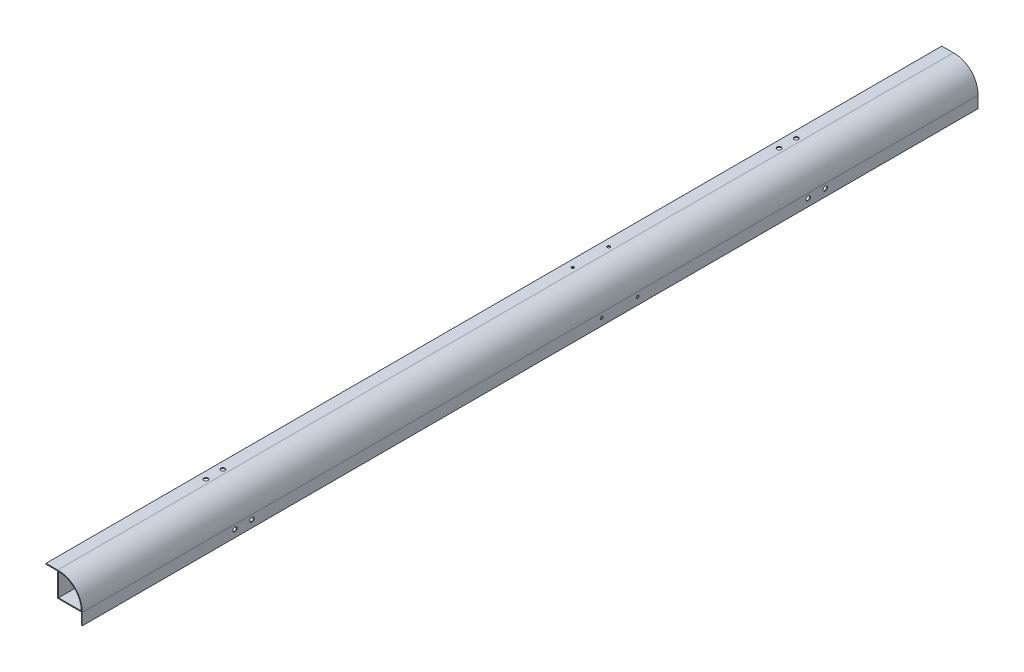
ISO-10303-21;
HEADER;
FILE_DESCRIPTION(('STEP AP214'),'2;1');
FILE_NAME('part.step','',(''),(''),'','','');
FILE_SCHEMA(('AUTOMOTIVE_DESIGN { 1 0 10303 214 1 1 1 1 }'));
ENDSEC;
DATA;
#1=APPLICATION_CONTEXT('core data for automotive mechanical design processes');
#2=APPLICATION_PROTOCOL_DEFINITION('international standard','automotive_design',2000,#1);
#3=PRODUCT_CONTEXT('',#1,'mechanical');
#4=PRODUCT('Part','Part','',(#3));
#5=PRODUCT_RELATED_PRODUCT_CATEGORY('part','',(#4));
#6=PRODUCT_DEFINITION_FORMATION('','',#4);
#7=PRODUCT_DEFINITION_CONTEXT('part definition',#1,'design');
#8=PRODUCT_DEFINITION('design','',#6,#7);
#9=PRODUCT_DEFINITION_SHAPE('','',#8);
#10=(LENGTH_UNIT() NAMED_UNIT(*) SI_UNIT(.MILLI.,.METRE.));
#11=(NAMED_UNIT(*) PLANE_ANGLE_UNIT() SI_UNIT($,.RADIAN.));
#12=(NAMED_UNIT(*) SI_UNIT($,.STERADIAN.) SOLID_ANGLE_UNIT());
#13=UNCERTAINTY_MEASURE_WITH_UNIT(LENGTH_MEASURE(1.E-05),#10,'distance_accuracy_value','');
#14=(GEOMETRIC_REPRESENTATION_CONTEXT(3) GLOBAL_UNCERTAINTY_ASSIGNED_CONTEXT((#13)) GLOBAL_UNIT_ASSIGNED_CONTEXT((#10,
#11,#12)) REPRESENTATION_CONTEXT('',''));
#15=CARTESIAN_POINT('',(0.,0.,0.));
#16=DIRECTION('',(0.,0.,1.));
#17=DIRECTION('',(1.,0.,0.));
#18=AXIS2_PLACEMENT_3D('',#15,#16,#17);
#19=CARTESIAN_POINT('',(12.6810538076097,0.,500.));
#20=DIRECTION('',(1.,0.,0.));
#21=DIRECTION('',(0.,1.,0.));
#22=AXIS2_PLACEMENT_3D('',#19,#20,#21);
#23=PLANE('',#22);
#24=CARTESIAN_POINT('',(12.6810538076097,-18.7,-120.));
#25=DIRECTION('',(1.,0.,0.));
#26=DIRECTION('',(0.,1.,0.));
#27=AXIS2_PLACEMENT_3D('',#24,#25,#26);
#28=CIRCLE('',#27,1.5);
#29=CARTESIAN_POINT('',(12.6810538076097,-17.2,-120.));
#30=VERTEX_POINT('',#29);
#31=EDGE_CURVE('E233',#30,#30,#28,.T.);
#32=ORIENTED_EDGE('',*,*,#31,.T.);
#33=EDGE_LOOP('',(#32));
#34=FACE_BOUND('',#33,.T.);
#35=DIRECTION('',(0.,-1.,0.));
#36=VECTOR('',#35,1.);
#37=CARTESIAN_POINT('',(12.6810538076097,0.,-500.));
#38=LINE('',#37,#36);
#39=CARTESIAN_POINT('',(12.6810538076097,-13.7,-500.));
#40=VERTEX_POINT('',#39);
#41=CARTESIAN_POINT('',(12.6810538076097,-26.7,-500.));
#42=VERTEX_POINT('',#41);
#43=EDGE_CURVE('E276',#40,#42,#38,.T.);
#44=ORIENTED_EDGE('',*,*,#43,.T.);
#45=DIRECTION('',(0.,0.,-1.));
#46=VECTOR('',#45,1.);
#47=CARTESIAN_POINT('',(12.6810538076097,-26.7,500.));
#48=LINE('',#47,#46);
#49=CARTESIAN_POINT('',(12.6810538076097,-26.7,500.));
#50=VERTEX_POINT('',#49);
#51=EDGE_CURVE('E166',#50,#42,#48,.T.);
#52=ORIENTED_EDGE('',*,*,#51,.F.);
#53=DIRECTION('',(0.,-1.,0.));
#54=VECTOR('',#53,1.);
#55=CARTESIAN_POINT('',(12.6810538076097,0.,500.));
#56=LINE('',#55,#54);
#57=CARTESIAN_POINT('',(12.6810538076097,-13.7,500.));
#58=VERTEX_POINT('',#57);
#59=EDGE_CURVE('E253',#58,#50,#56,.T.);
#60=ORIENTED_EDGE('',*,*,#59,.F.);
#61=DIRECTION('',(0.,0.,-1.));
#62=VECTOR('',#61,1.);
#63=CARTESIAN_POINT('',(12.6810538076097,-13.7,500.));
#64=LINE('',#63,#62);
#65=EDGE_CURVE('E168',#58,#40,#64,.T.);
#66=ORIENTED_EDGE('',*,*,#65,.T.);
#67=EDGE_LOOP('',(#44,#52,#60,#66));
#68=FACE_BOUND('',#67,.T.);
#69=CARTESIAN_POINT('',(12.6810538076097,-18.7,-80.));
#70=DIRECTION('',(1.,0.,0.));
#71=DIRECTION('',(0.,1.,0.));
#72=AXIS2_PLACEMENT_3D('',#69,#70,#71);
#73=CIRCLE('',#72,1.5);
#74=CARTESIAN_POINT('',(12.6810538076097,-17.2,-80.));
#75=VERTEX_POINT('',#74);
#76=EDGE_CURVE('E221',#75,#75,#73,.F.);
#77=ORIENTED_EDGE('',*,*,#76,.F.);
#78=EDGE_LOOP('',(#77));
#79=FACE_BOUND('',#78,.T.);
#80=CARTESIAN_POINT('',(12.6810538076097,-18.7000000000001,329.5));
#81=DIRECTION('',(1.,0.,0.));
#82=DIRECTION('',(0.,1.,0.));
#83=AXIS2_PLACEMENT_3D('',#80,#81,#82);
#84=CIRCLE('',#83,2.38125000000001);
#85=CARTESIAN_POINT('',(12.6810538076097,-16.3187500000001,329.5));
#86=VERTEX_POINT('',#85);
#87=EDGE_CURVE('E224',#86,#86,#84,.F.);
#88=ORIENTED_EDGE('',*,*,#87,.F.);
#89=EDGE_LOOP('',(#88));
#90=FACE_BOUND('',#89,.T.);
#91=CARTESIAN_POINT('',(12.6810538076097,-18.7000000000001,310.5));
#92=DIRECTION('',(1.,0.,0.));
#93=DIRECTION('',(0.,1.,0.));
#94=AXIS2_PLACEMENT_3D('',#91,#92,#93);
#95=CIRCLE('',#94,2.38125000000001);
#96=CARTESIAN_POINT('',(12.6810538076097,-16.3187500000001,310.5));
#97=VERTEX_POINT('',#96);
#98=EDGE_CURVE('E227',#97,#97,#95,.F.);
#99=ORIENTED_EDGE('',*,*,#98,.F.);
#100=EDGE_LOOP('',(#99));
#101=FACE_BOUND('',#100,.T.);
#102=CARTESIAN_POINT('',(12.6810538076097,-18.7,-310.5));
#103=DIRECTION('',(1.,0.,0.));
#104=DIRECTION('',(0.,1.,0.));
#105=AXIS2_PLACEMENT_3D('',#102,#103,#104);
#106=CIRCLE('',#105,2.38125000000001);
#107=CARTESIAN_POINT('',(12.6810538076097,-16.31875,-310.5));
#108=VERTEX_POINT('',#107);
#109=EDGE_CURVE('E230',#108,#108,#106,.T.);
#110=ORIENTED_EDGE('',*,*,#109,.T.);
#111=EDGE_LOOP('',(#110));
#112=FACE_BOUND('',#111,.T.);
#113=CARTESIAN_POINT('',(12.6810538076097,-18.7,-329.5));
#114=DIRECTION('',(1.,0.,0.));
#115=DIRECTION('',(0.,1.,0.));
#116=AXIS2_PLACEMENT_3D('',#113,#114,#115);
#117=CIRCLE('',#116,2.38125000000001);
#118=CARTESIAN_POINT('',(12.6810538076097,-16.31875,-329.5));
#119=VERTEX_POINT('',#118);
#120=EDGE_CURVE('E236',#119,#119,#117,.T.);
#121=ORIENTED_EDGE('',*,*,#120,.T.);
#122=EDGE_LOOP('',(#121));
#123=FACE_BOUND('',#122,.T.);
#124=ADVANCED_FACE('F36',(#34,#68,#79,#90,#101,#112,#123),#23,.F.);
#125=CARTESIAN_POINT('',(13.6810538076097,0.,500.));
#126=DIRECTION('',(1.,0.,0.));
#127=DIRECTION('',(0.,0.,-1.));
#128=AXIS2_PLACEMENT_3D('',#125,#126,#127);
#129=PLANE('',#128);
#130=CARTESIAN_POINT('',(13.6810538076097,-18.7000000000001,310.5));
#131=DIRECTION('',(-1.,0.,0.));
#132=DIRECTION('',(0.,-1.,0.));
#133=AXIS2_PLACEMENT_3D('',#130,#131,#132);
#134=CIRCLE('',#133,2.38125000000001);
#135=CARTESIAN_POINT('',(13.6810538076097,-21.0812500000001,310.5));
#136=VERTEX_POINT('',#135);
#137=EDGE_CURVE('E214',#136,#136,#134,.T.);
#138=ORIENTED_EDGE('',*,*,#137,.T.);
#139=EDGE_LOOP('',(#138));
#140=FACE_BOUND('',#139,.T.);
#141=CARTESIAN_POINT('',(13.6810538076097,-18.7000000000001,329.5));
#142=DIRECTION('',(-1.,0.,0.));
#143=DIRECTION('',(0.,-1.,0.));
#144=AXIS2_PLACEMENT_3D('',#141,#142,#143);
#145=CIRCLE('',#144,2.38125000000001);
#146=CARTESIAN_POINT('',(13.6810538076097,-21.0812500000001,329.5));
#147=VERTEX_POINT('',#146);
#148=EDGE_CURVE('E207',#147,#147,#145,.T.);
#149=ORIENTED_EDGE('',*,*,#148,.T.);
#150=EDGE_LOOP('',(#149));
#151=FACE_BOUND('',#150,.T.);
#152=CARTESIAN_POINT('',(13.6810538076097,-18.7,-80.));
#153=DIRECTION('',(-1.,0.,0.));
#154=DIRECTION('',(0.,-1.,0.));
#155=AXIS2_PLACEMENT_3D('',#152,#153,#154);
#156=CIRCLE('',#155,1.5);
#157=CARTESIAN_POINT('',(13.6810538076097,-20.2,-80.));
#158=VERTEX_POINT('',#157);
#159=EDGE_CURVE('E202',#158,#158,#156,.T.);
#160=ORIENTED_EDGE('',*,*,#159,.T.);
#161=EDGE_LOOP('',(#160));
#162=FACE_BOUND('',#161,.T.);
#163=DIRECTION('',(0.,-1.,0.));
#164=VECTOR('',#163,1.);
#165=CARTESIAN_POINT('',(13.6810538076097,0.,-500.));
#166=LINE('',#165,#164);
#167=CARTESIAN_POINT('',(13.6810538076097,-13.7,-500.));
#168=VERTEX_POINT('',#167);
#169=CARTESIAN_POINT('',(13.6810538076097,-26.7,-500.));
#170=VERTEX_POINT('',#169);
#171=EDGE_CURVE('E149',#168,#170,#166,.T.);
#172=ORIENTED_EDGE('',*,*,#171,.F.);
#173=DIRECTION('',(0.,0.,-1.));
#174=VECTOR('',#173,1.);
#175=CARTESIAN_POINT('',(13.6810538076097,-13.7,500.));
#176=LINE('',#175,#174);
#177=CARTESIAN_POINT('',(13.6810538076097,-13.7,500.));
#178=VERTEX_POINT('',#177);
#179=EDGE_CURVE('E162',#178,#168,#176,.T.);
#180=ORIENTED_EDGE('',*,*,#179,.F.);
#181=DIRECTION('',(0.,-1.,0.));
#182=VECTOR('',#181,1.);
#183=CARTESIAN_POINT('',(13.6810538076097,0.,500.));
#184=LINE('',#183,#182);
#185=CARTESIAN_POINT('',(13.6810538076097,-26.7,500.));
#186=VERTEX_POINT('',#185);
#187=EDGE_CURVE('E142',#178,#186,#184,.T.);
#188=ORIENTED_EDGE('',*,*,#187,.T.);
#189=DIRECTION('',(0.,0.,-1.));
#190=VECTOR('',#189,1.);
#191=CARTESIAN_POINT('',(13.6810538076097,-26.7,500.));
#192=LINE('',#191,#190);
#193=EDGE_CURVE('E164',#186,#170,#192,.T.);
#194=ORIENTED_EDGE('',*,*,#193,.T.);
#195=EDGE_LOOP('',(#172,#180,#188,#194));
#196=FACE_BOUND('',#195,.T.);
#197=CARTESIAN_POINT('',(13.6810538076097,-18.7,-310.5));
#198=DIRECTION('',(1.,0.,0.));
#199=DIRECTION('',(0.,1.,0.));
#200=AXIS2_PLACEMENT_3D('',#197,#198,#199);
#201=CIRCLE('',#200,2.38125000000001);
#202=CARTESIAN_POINT('',(13.6810538076097,-16.31875,-310.5));
#203=VERTEX_POINT('',#202);
#204=EDGE_CURVE('E216',#203,#203,#201,.T.);
#205=ORIENTED_EDGE('',*,*,#204,.F.);
#206=EDGE_LOOP('',(#205));
#207=FACE_BOUND('',#206,.T.);
#208=CARTESIAN_POINT('',(13.6810538076097,-18.7,-120.));
#209=DIRECTION('',(1.,0.,0.));
#210=DIRECTION('',(0.,1.,0.));
#211=AXIS2_PLACEMENT_3D('',#208,#209,#210);
#212=CIRCLE('',#211,1.5);
#213=CARTESIAN_POINT('',(13.6810538076097,-17.2,-120.));
#214=VERTEX_POINT('',#213);
#215=EDGE_CURVE('E198',#214,#214,#212,.T.);
#216=ORIENTED_EDGE('',*,*,#215,.F.);
#217=EDGE_LOOP('',(#216));
#218=FACE_BOUND('',#217,.T.);
#219=CARTESIAN_POINT('',(13.6810538076097,-18.7,-329.5));
#220=DIRECTION('',(1.,0.,0.));
#221=DIRECTION('',(0.,1.,0.));
#222=AXIS2_PLACEMENT_3D('',#219,#220,#221);
#223=CIRCLE('',#222,2.38125000000001);
#224=CARTESIAN_POINT('',(13.6810538076097,-16.31875,-329.5));
#225=VERTEX_POINT('',#224);
#226=EDGE_CURVE('E211',#225,#225,#223,.T.);
#227=ORIENTED_EDGE('',*,*,#226,.F.);
#228=EDGE_LOOP('',(#227));
#229=FACE_BOUND('',#228,.T.);
#230=ADVANCED_FACE('F317',(#140,#151,#162,#196,#207,#218,#229),#129,.T.);
#231=CARTESIAN_POINT('',(-12.7,0.,500.));
#232=DIRECTION('',(-1.,0.,0.));
#233=DIRECTION('',(0.,-1.,0.));
#234=AXIS2_PLACEMENT_3D('',#231,#232,#233);
#235=PLANE('',#234);
#236=DIRECTION('',(0.,1.,0.));
#237=VECTOR('',#236,1.);
#238=CARTESIAN_POINT('',(-12.7,0.,-500.));
#239=LINE('',#238,#237);
#240=CARTESIAN_POINT('',(-12.7,-12.7,-500.));
#241=VERTEX_POINT('',#240);
#242=CARTESIAN_POINT('',(-12.7,12.7,-500.));
#243=VERTEX_POINT('',#242);
#244=EDGE_CURVE('E145',#241,#243,#239,.T.);
#245=ORIENTED_EDGE('',*,*,#244,.T.);
#246=DIRECTION('',(0.,0.,-1.));
#247=VECTOR('',#246,1.);
#248=CARTESIAN_POINT('',(-12.7,12.7,500.));
#249=LINE('',#248,#247);
#250=CARTESIAN_POINT('',(-12.7,12.7,500.));
#251=VERTEX_POINT('',#250);
#252=EDGE_CURVE('E11',#251,#243,#249,.T.);
#253=ORIENTED_EDGE('',*,*,#252,.F.);
#254=DIRECTION('',(0.,1.,0.));
#255=VECTOR('',#254,1.);
#256=CARTESIAN_POINT('',(-12.7,0.,500.));
#257=LINE('',#256,#255);
#258=CARTESIAN_POINT('',(-12.7,-12.7,500.));
#259=VERTEX_POINT('',#258);
#260=EDGE_CURVE('E139',#259,#251,#257,.T.);
#261=ORIENTED_EDGE('',*,*,#260,.F.);
#262=DIRECTION('',(0.,0.,-1.));
#263=VECTOR('',#262,1.);
#264=CARTESIAN_POINT('',(-12.7,-12.7,500.));
#265=LINE('',#264,#263);
#266=EDGE_CURVE('E55',#259,#241,#265,.T.);
#267=ORIENTED_EDGE('',*,*,#266,.T.);
#268=EDGE_LOOP('',(#245,#253,#261,#267));
#269=FACE_BOUND('',#268,.T.);
#270=ADVANCED_FACE('F144',(#269),#235,.F.);
#271=CARTESIAN_POINT('',(-12.7,-12.7,500.));
#272=DIRECTION('',(0.,0.,-1.));
#273=DIRECTION('',(-1.,0.,0.));
#274=AXIS2_PLACEMENT_3D('',#271,#272,#273);
#275=CYLINDRICAL_SURFACE('',#274,25.4);
#276=CARTESIAN_POINT('',(-12.7,-12.7,-500.));
#277=DIRECTION('',(0.,0.,1.));
#278=DIRECTION('',(1.,0.,0.));
#279=AXIS2_PLACEMENT_3D('',#276,#277,#278);
#280=CIRCLE('',#279,25.4);
#281=CARTESIAN_POINT('',(12.7,-12.7,-500.));
#282=VERTEX_POINT('',#281);
#283=EDGE_CURVE('E148',#243,#282,#280,.F.);
#284=ORIENTED_EDGE('',*,*,#283,.T.);
#285=DIRECTION('',(0.,0.,-1.));
#286=VECTOR('',#285,1.);
#287=CARTESIAN_POINT('',(12.7,-12.7,500.));
#288=LINE('',#287,#286);
#289=CARTESIAN_POINT('',(12.7,-12.7,500.));
#290=VERTEX_POINT('',#289);
#291=EDGE_CURVE('E46',#290,#282,#288,.T.);
#292=ORIENTED_EDGE('',*,*,#291,.F.);
#293=CARTESIAN_POINT('',(-12.7,-12.7,500.));
#294=DIRECTION('',(0.,0.,1.));
#295=DIRECTION('',(1.,0.,0.));
#296=AXIS2_PLACEMENT_3D('',#293,#294,#295);
#297=CIRCLE('',#296,25.4);
#298=EDGE_CURVE('E132',#251,#290,#297,.F.);
#299=ORIENTED_EDGE('',*,*,#298,.F.);
#300=ORIENTED_EDGE('',*,*,#252,.T.);
#301=EDGE_LOOP('',(#284,#292,#299,#300));
#302=FACE_BOUND('',#301,.T.);
#303=ADVANCED_FACE('F134',(#302),#275,.F.);
#304=CARTESIAN_POINT('',(-12.7,-12.7,500.));
#305=DIRECTION('',(0.,0.,-1.));
#306=DIRECTION('',(-1.,0.,0.));
#307=AXIS2_PLACEMENT_3D('',#304,#305,#306);
#308=CYLINDRICAL_SURFACE('',#307,26.4);
#309=CARTESIAN_POINT('',(-12.7,-12.7,-500.));
#310=DIRECTION('',(0.,0.,1.));
#311=DIRECTION('',(1.,0.,0.));
#312=AXIS2_PLACEMENT_3D('',#309,#310,#311);
#313=CIRCLE('',#312,26.4);
#314=CARTESIAN_POINT('',(-13.7,13.6810538076097,-500.));
#315=VERTEX_POINT('',#314);
#316=EDGE_CURVE('E239',#315,#168,#313,.F.);
#317=ORIENTED_EDGE('',*,*,#316,.F.);
#318=DIRECTION('',(0.,0.,-1.));
#319=VECTOR('',#318,1.);
#320=CARTESIAN_POINT('',(-13.7,13.6810538076097,500.));
#321=LINE('',#320,#319);
#322=CARTESIAN_POINT('',(-13.7,13.6810538076097,500.));
#323=VERTEX_POINT('',#322);
#324=EDGE_CURVE('E105',#323,#315,#321,.T.);
#325=ORIENTED_EDGE('',*,*,#324,.F.);
#326=CARTESIAN_POINT('',(-12.7,-12.7,500.));
#327=DIRECTION('',(0.,0.,1.));
#328=DIRECTION('',(1.,0.,0.));
#329=AXIS2_PLACEMENT_3D('',#326,#327,#328);
#330=CIRCLE('',#329,26.4);
#331=EDGE_CURVE('E159',#323,#178,#330,.F.);
#332=ORIENTED_EDGE('',*,*,#331,.T.);
#333=ORIENTED_EDGE('',*,*,#179,.T.);
#334=EDGE_LOOP('',(#317,#325,#332,#333));
#335=FACE_BOUND('',#334,.T.);
#336=ADVANCED_FACE('F38',(#335),#308,.T.);
#337=CARTESIAN_POINT('',(0.,13.6810538076097,500.));
#338=DIRECTION('',(0.,-1.,0.));
#339=DIRECTION('',(0.,0.,-1.));
#340=AXIS2_PLACEMENT_3D('',#337,#338,#339);
#341=PLANE('',#340);
#342=CARTESIAN_POINT('',(-18.7,13.6810538076097,-329.5));
#343=DIRECTION('',(0.,1.,0.));
#344=DIRECTION('',(-1.,0.,0.));
#345=AXIS2_PLACEMENT_3D('',#342,#343,#344);
#346=CIRCLE('',#345,2.38125000000004);
#347=CARTESIAN_POINT('',(-21.08125,13.6810538076097,-329.5));
#348=VERTEX_POINT('',#347);
#349=EDGE_CURVE('E185',#348,#348,#346,.T.);
#350=ORIENTED_EDGE('',*,*,#349,.F.);
#351=EDGE_LOOP('',(#350));
#352=FACE_BOUND('',#351,.T.);
#353=CARTESIAN_POINT('',(-18.7,13.6810538076097,-79.9999999999999));
#354=DIRECTION('',(0.,1.,0.));
#355=DIRECTION('',(1.,0.,0.));
#356=AXIS2_PLACEMENT_3D('',#353,#354,#355);
#357=CIRCLE('',#356,1.5);
#358=CARTESIAN_POINT('',(-17.2,13.6810538076097,-79.9999999999999));
#359=VERTEX_POINT('',#358);
#360=EDGE_CURVE('E362',#359,#359,#357,.T.);
#361=ORIENTED_EDGE('',*,*,#360,.F.);
#362=EDGE_LOOP('',(#361));
#363=FACE_BOUND('',#362,.T.);
#364=CARTESIAN_POINT('',(-18.7,13.6810538076097,-310.5));
#365=DIRECTION('',(0.,1.,0.));
#366=DIRECTION('',(-1.,0.,0.));
#367=AXIS2_PLACEMENT_3D('',#364,#365,#366);
#368=CIRCLE('',#367,2.38125000000004);
#369=CARTESIAN_POINT('',(-21.08125,13.6810538076097,-310.5));
#370=VERTEX_POINT('',#369);
#371=EDGE_CURVE('E366',#370,#370,#368,.T.);
#372=ORIENTED_EDGE('',*,*,#371,.F.);
#373=EDGE_LOOP('',(#372));
#374=FACE_BOUND('',#373,.T.);
#375=CARTESIAN_POINT('',(-18.6999999999999,13.6810538076097,310.5));
#376=DIRECTION('',(0.,1.,0.));
#377=DIRECTION('',(1.,0.,0.));
#378=AXIS2_PLACEMENT_3D('',#375,#376,#377);
#379=CIRCLE('',#378,2.38125000000004);
#380=CARTESIAN_POINT('',(-16.3187499999999,13.6810538076097,310.5));
#381=VERTEX_POINT('',#380);
#382=EDGE_CURVE('E370',#381,#381,#379,.T.);
#383=ORIENTED_EDGE('',*,*,#382,.F.);
#384=EDGE_LOOP('',(#383));
#385=FACE_BOUND('',#384,.T.);
#386=CARTESIAN_POINT('',(-18.6999999999999,13.6810538076097,329.5));
#387=DIRECTION('',(0.,1.,0.));
#388=DIRECTION('',(1.,0.,0.));
#389=AXIS2_PLACEMENT_3D('',#386,#387,#388);
#390=CIRCLE('',#389,2.38125000000004);
#391=CARTESIAN_POINT('',(-16.3187499999999,13.6810538076097,329.5));
#392=VERTEX_POINT('',#391);
#393=EDGE_CURVE('E374',#392,#392,#390,.T.);
#394=ORIENTED_EDGE('',*,*,#393,.F.);
#395=EDGE_LOOP('',(#394));
#396=FACE_BOUND('',#395,.T.);
#397=CARTESIAN_POINT('',(-18.7,13.6810538076097,-120.));
#398=DIRECTION('',(0.,1.,0.));
#399=DIRECTION('',(-1.,0.,0.));
#400=AXIS2_PLACEMENT_3D('',#397,#398,#399);
#401=CIRCLE('',#400,1.5);
#402=CARTESIAN_POINT('',(-20.2,13.6810538076097,-120.));
#403=VERTEX_POINT('',#402);
#404=EDGE_CURVE('E377',#403,#403,#401,.T.);
#405=ORIENTED_EDGE('',*,*,#404,.F.);
#406=EDGE_LOOP('',(#405));
#407=FACE_BOUND('',#406,.T.);
#408=DIRECTION('',(-1.,0.,0.));
#409=VECTOR('',#408,1.);
#410=CARTESIAN_POINT('',(0.,13.6810538076097,-500.));
#411=LINE('',#410,#409);
#412=CARTESIAN_POINT('',(-26.7,13.6810538076097,-500.));
#413=VERTEX_POINT('',#412);
#414=EDGE_CURVE('E263',#315,#413,#411,.T.);
#415=ORIENTED_EDGE('',*,*,#414,.T.);
#416=DIRECTION('',(0.,0.,-1.));
#417=VECTOR('',#416,1.);
#418=CARTESIAN_POINT('',(-26.7,13.6810538076097,500.));
#419=LINE('',#418,#417);
#420=CARTESIAN_POINT('',(-26.7,13.6810538076097,500.));
#421=VERTEX_POINT('',#420);
#422=EDGE_CURVE('E177',#421,#413,#419,.T.);
#423=ORIENTED_EDGE('',*,*,#422,.F.);
#424=DIRECTION('',(-1.,0.,0.));
#425=VECTOR('',#424,1.);
#426=CARTESIAN_POINT('',(0.,13.6810538076097,500.));
#427=LINE('',#426,#425);
#428=EDGE_CURVE('E241',#323,#421,#427,.T.);
#429=ORIENTED_EDGE('',*,*,#428,.F.);
#430=ORIENTED_EDGE('',*,*,#324,.T.);
#431=EDGE_LOOP('',(#415,#423,#429,#430));
#432=FACE_BOUND('',#431,.T.);
#433=ADVANCED_FACE('F312',(#352,#363,#374,#385,#396,#407,#432),#341,.F.);
#434=CARTESIAN_POINT('',(-26.7,0.,500.));
#435=DIRECTION('',(1.,0.,0.));
#436=DIRECTION('',(0.,0.,-1.));
#437=AXIS2_PLACEMENT_3D('',#434,#435,#436);
#438=PLANE('',#437);
#439=DIRECTION('',(0.,-1.,0.));
#440=VECTOR('',#439,1.);
#441=CARTESIAN_POINT('',(-26.7,0.,-500.));
#442=LINE('',#441,#440);
#443=CARTESIAN_POINT('',(-26.7,12.6810538076097,-500.));
#444=VERTEX_POINT('',#443);
#445=EDGE_CURVE('E265',#413,#444,#442,.T.);
#446=ORIENTED_EDGE('',*,*,#445,.T.);
#447=DIRECTION('',(0.,0.,-1.));
#448=VECTOR('',#447,1.);
#449=CARTESIAN_POINT('',(-26.7,12.6810538076097,500.));
#450=LINE('',#449,#448);
#451=CARTESIAN_POINT('',(-26.7,12.6810538076097,500.));
#452=VERTEX_POINT('',#451);
#453=EDGE_CURVE('E175',#452,#444,#450,.T.);
#454=ORIENTED_EDGE('',*,*,#453,.F.);
#455=DIRECTION('',(0.,-1.,0.));
#456=VECTOR('',#455,1.);
#457=CARTESIAN_POINT('',(-26.7,0.,500.));
#458=LINE('',#457,#456);
#459=EDGE_CURVE('E243',#421,#452,#458,.T.);
#460=ORIENTED_EDGE('',*,*,#459,.F.);
#461=ORIENTED_EDGE('',*,*,#422,.T.);
#462=EDGE_LOOP('',(#446,#454,#460,#461));
#463=FACE_BOUND('',#462,.T.);
#464=ADVANCED_FACE('F308',(#463),#438,.F.);
#465=CARTESIAN_POINT('',(0.,12.6810538076097,500.));
#466=DIRECTION('',(0.,-1.,0.));
#467=DIRECTION('',(1.,0.,0.));
#468=AXIS2_PLACEMENT_3D('',#465,#466,#467);
#469=PLANE('',#468);
#470=CARTESIAN_POINT('',(-18.7,12.6810538076097,-329.5));
#471=DIRECTION('',(0.,-1.,0.));
#472=DIRECTION('',(1.,0.,0.));
#473=AXIS2_PLACEMENT_3D('',#470,#471,#472);
#474=CIRCLE('',#473,2.38125000000004);
#475=CARTESIAN_POINT('',(-16.31875,12.6810538076097,-329.5));
#476=VERTEX_POINT('',#475);
#477=EDGE_CURVE('E40',#476,#476,#474,.T.);
#478=ORIENTED_EDGE('',*,*,#477,.F.);
#479=EDGE_LOOP('',(#478));
#480=FACE_BOUND('',#479,.T.);
#481=CARTESIAN_POINT('',(-18.7,12.6810538076097,-79.9999999999999));
#482=DIRECTION('',(0.,-1.,0.));
#483=DIRECTION('',(1.,0.,0.));
#484=AXIS2_PLACEMENT_3D('',#481,#482,#483);
#485=CIRCLE('',#484,1.5);
#486=CARTESIAN_POINT('',(-17.2,12.6810538076097,-79.9999999999999));
#487=VERTEX_POINT('',#486);
#488=EDGE_CURVE('E193',#487,#487,#485,.T.);
#489=ORIENTED_EDGE('',*,*,#488,.F.);
#490=EDGE_LOOP('',(#489));
#491=FACE_BOUND('',#490,.T.);
#492=CARTESIAN_POINT('',(-18.7,12.6810538076097,-310.5));
#493=DIRECTION('',(0.,-1.,0.));
#494=DIRECTION('',(1.,0.,0.));
#495=AXIS2_PLACEMENT_3D('',#492,#493,#494);
#496=CIRCLE('',#495,2.38125000000004);
#497=CARTESIAN_POINT('',(-16.31875,12.6810538076097,-310.5));
#498=VERTEX_POINT('',#497);
#499=EDGE_CURVE('E191',#498,#498,#496,.T.);
#500=ORIENTED_EDGE('',*,*,#499,.F.);
#501=EDGE_LOOP('',(#500));
#502=FACE_BOUND('',#501,.T.);
#503=CARTESIAN_POINT('',(-18.6999999999999,12.6810538076097,310.5));
#504=DIRECTION('',(0.,-1.,0.));
#505=DIRECTION('',(1.,0.,0.));
#506=AXIS2_PLACEMENT_3D('',#503,#504,#505);
#507=CIRCLE('',#506,2.38125000000004);
#508=CARTESIAN_POINT('',(-16.3187499999999,12.6810538076097,310.5));
#509=VERTEX_POINT('',#508);
#510=EDGE_CURVE('E188',#509,#509,#507,.T.);
#511=ORIENTED_EDGE('',*,*,#510,.F.);
#512=EDGE_LOOP('',(#511));
#513=FACE_BOUND('',#512,.T.);
#514=CARTESIAN_POINT('',(-18.6999999999999,12.6810538076097,329.5));
#515=DIRECTION('',(0.,-1.,0.));
#516=DIRECTION('',(1.,0.,0.));
#517=AXIS2_PLACEMENT_3D('',#514,#515,#516);
#518=CIRCLE('',#517,2.38125000000004);
#519=CARTESIAN_POINT('',(-16.3187499999999,12.6810538076097,329.5));
#520=VERTEX_POINT('',#519);
#521=EDGE_CURVE('E184',#520,#520,#518,.T.);
#522=ORIENTED_EDGE('',*,*,#521,.F.);
#523=EDGE_LOOP('',(#522));
#524=FACE_BOUND('',#523,.T.);
#525=CARTESIAN_POINT('',(-18.7,12.6810538076097,-120.));
#526=DIRECTION('',(0.,-1.,0.));
#527=DIRECTION('',(1.,0.,0.));
#528=AXIS2_PLACEMENT_3D('',#525,#526,#527);
#529=CIRCLE('',#528,1.5);
#530=CARTESIAN_POINT('',(-17.2,12.6810538076097,-120.));
#531=VERTEX_POINT('',#530);
#532=EDGE_CURVE('E181',#531,#531,#529,.T.);
#533=ORIENTED_EDGE('',*,*,#532,.F.);
#534=EDGE_LOOP('',(#533));
#535=FACE_BOUND('',#534,.T.);
#536=DIRECTION('',(-1.,0.,0.));
#537=VECTOR('',#536,1.);
#538=CARTESIAN_POINT('',(0.,12.6810538076097,-500.));
#539=LINE('',#538,#537);
#540=CARTESIAN_POINT('',(-13.7,12.6810538076097,-500.));
#541=VERTEX_POINT('',#540);
#542=EDGE_CURVE('E268',#541,#444,#539,.T.);
#543=ORIENTED_EDGE('',*,*,#542,.F.);
#544=DIRECTION('',(0.,0.,-1.));
#545=VECTOR('',#544,1.);
#546=CARTESIAN_POINT('',(-13.7,12.6810538076097,500.));
#547=LINE('',#546,#545);
#548=CARTESIAN_POINT('',(-13.7,12.6810538076097,500.));
#549=VERTEX_POINT('',#548);
#550=EDGE_CURVE('E173',#549,#541,#547,.T.);
#551=ORIENTED_EDGE('',*,*,#550,.F.);
#552=DIRECTION('',(-1.,0.,0.));
#553=VECTOR('',#552,1.);
#554=CARTESIAN_POINT('',(0.,12.6810538076097,500.));
#555=LINE('',#554,#553);
#556=EDGE_CURVE('E245',#549,#452,#555,.T.);
#557=ORIENTED_EDGE('',*,*,#556,.T.);
#558=ORIENTED_EDGE('',*,*,#453,.T.);
#559=EDGE_LOOP('',(#543,#551,#557,#558));
#560=FACE_BOUND('',#559,.T.);
#561=ADVANCED_FACE('F303',(#480,#491,#502,#513,#524,#535,#560),#469,.T.);
#562=CARTESIAN_POINT('',(-13.7,0.,500.));
#563=DIRECTION('',(-1.,0.,0.));
#564=DIRECTION('',(0.,-1.,0.));
#565=AXIS2_PLACEMENT_3D('',#562,#563,#564);
#566=PLANE('',#565);
#567=DIRECTION('',(0.,1.,0.));
#568=VECTOR('',#567,1.);
#569=CARTESIAN_POINT('',(-13.7,0.,-500.));
#570=LINE('',#569,#568);
#571=CARTESIAN_POINT('',(-13.7,-13.7,-500.));
#572=VERTEX_POINT('',#571);
#573=EDGE_CURVE('E271',#572,#541,#570,.T.);
#574=ORIENTED_EDGE('',*,*,#573,.F.);
#575=DIRECTION('',(0.,0.,-1.));
#576=VECTOR('',#575,1.);
#577=CARTESIAN_POINT('',(-13.7,-13.7,500.));
#578=LINE('',#577,#576);
#579=CARTESIAN_POINT('',(-13.7,-13.7,500.));
#580=VERTEX_POINT('',#579);
#581=EDGE_CURVE('E171',#580,#572,#578,.T.);
#582=ORIENTED_EDGE('',*,*,#581,.F.);
#583=DIRECTION('',(0.,1.,0.));
#584=VECTOR('',#583,1.);
#585=CARTESIAN_POINT('',(-13.7,0.,500.));
#586=LINE('',#585,#584);
#587=EDGE_CURVE('E248',#580,#549,#586,.T.);
#588=ORIENTED_EDGE('',*,*,#587,.T.);
#589=ORIENTED_EDGE('',*,*,#550,.T.);
#590=EDGE_LOOP('',(#574,#582,#588,#589));
#591=FACE_BOUND('',#590,.T.);
#592=ADVANCED_FACE('F299',(#591),#566,.T.);
#593=CARTESIAN_POINT('',(0.,-13.7,500.));
#594=DIRECTION('',(0.,1.,0.));
#595=DIRECTION('',(0.,0.,1.));
#596=AXIS2_PLACEMENT_3D('',#593,#594,#595);
#597=PLANE('',#596);
#598=DIRECTION('',(1.,0.,0.));
#599=VECTOR('',#598,1.);
#600=CARTESIAN_POINT('',(0.,-13.7,-500.));
#601=LINE('',#600,#599);
#602=EDGE_CURVE('E274',#572,#40,#601,.T.);
#603=ORIENTED_EDGE('',*,*,#602,.T.);
#604=ORIENTED_EDGE('',*,*,#65,.F.);
#605=DIRECTION('',(1.,0.,0.));
#606=VECTOR('',#605,1.);
#607=CARTESIAN_POINT('',(0.,-13.7,500.));
#608=LINE('',#607,#606);
#609=EDGE_CURVE('E251',#580,#58,#608,.T.);
#610=ORIENTED_EDGE('',*,*,#609,.F.);
#611=ORIENTED_EDGE('',*,*,#581,.T.);
#612=EDGE_LOOP('',(#603,#604,#610,#611));
#613=FACE_BOUND('',#612,.T.);
#614=ADVANCED_FACE('F295',(#613),#597,.F.);
#615=CARTESIAN_POINT('',(0.,-26.7,500.));
#616=DIRECTION('',(0.,-1.,0.));
#617=DIRECTION('',(0.,0.,-1.));
#618=AXIS2_PLACEMENT_3D('',#615,#616,#617);
#619=PLANE('',#618);
#620=DIRECTION('',(-1.,0.,0.));
#621=VECTOR('',#620,1.);
#622=CARTESIAN_POINT('',(0.,-26.7,-500.));
#623=LINE('',#622,#621);
#624=EDGE_CURVE('E154',#170,#42,#623,.T.);
#625=ORIENTED_EDGE('',*,*,#624,.F.);
#626=ORIENTED_EDGE('',*,*,#193,.F.);
#627=DIRECTION('',(-1.,0.,0.));
#628=VECTOR('',#627,1.);
#629=CARTESIAN_POINT('',(0.,-26.7,500.));
#630=LINE('',#629,#628);
#631=EDGE_CURVE('E255',#186,#50,#630,.T.);
#632=ORIENTED_EDGE('',*,*,#631,.T.);
#633=ORIENTED_EDGE('',*,*,#51,.T.);
#634=EDGE_LOOP('',(#625,#626,#632,#633));
#635=FACE_BOUND('',#634,.T.);
#636=ADVANCED_FACE('F286',(#635),#619,.T.);
#637=CARTESIAN_POINT('',(0.,-12.7,500.));
#638=DIRECTION('',(0.,1.,0.));
#639=DIRECTION('',(-1.,0.,0.));
#640=AXIS2_PLACEMENT_3D('',#637,#638,#639);
#641=PLANE('',#640);
#642=DIRECTION('',(1.,0.,0.));
#643=VECTOR('',#642,1.);
#644=CARTESIAN_POINT('',(0.,-12.7,-500.));
#645=LINE('',#644,#643);
#646=EDGE_CURVE('E151',#241,#282,#645,.T.);
#647=ORIENTED_EDGE('',*,*,#646,.F.);
#648=ORIENTED_EDGE('',*,*,#266,.F.);
#649=DIRECTION('',(1.,0.,0.));
#650=VECTOR('',#649,1.);
#651=CARTESIAN_POINT('',(0.,-12.7,500.));
#652=LINE('',#651,#650);
#653=EDGE_CURVE('E138',#259,#290,#652,.T.);
#654=ORIENTED_EDGE('',*,*,#653,.T.);
#655=ORIENTED_EDGE('',*,*,#291,.T.);
#656=EDGE_LOOP('',(#647,#648,#654,#655));
#657=FACE_BOUND('',#656,.T.);
#658=ADVANCED_FACE('F421',(#657),#641,.T.);
#659=CARTESIAN_POINT('',(0.,0.,500.));
#660=DIRECTION('',(0.,0.,1.));
#661=DIRECTION('',(1.,0.,0.));
#662=AXIS2_PLACEMENT_3D('',#659,#660,#661);
#663=PLANE('',#662);
#664=ORIENTED_EDGE('',*,*,#331,.F.);
#665=ORIENTED_EDGE('',*,*,#428,.T.);
#666=ORIENTED_EDGE('',*,*,#459,.T.);
#667=ORIENTED_EDGE('',*,*,#556,.F.);
#668=ORIENTED_EDGE('',*,*,#587,.F.);
#669=ORIENTED_EDGE('',*,*,#609,.T.);
#670=ORIENTED_EDGE('',*,*,#59,.T.);
#671=ORIENTED_EDGE('',*,*,#631,.F.);
#672=ORIENTED_EDGE('',*,*,#187,.F.);
#673=EDGE_LOOP('',(#664,#665,#666,#667,#668,#669,#670,#671,#672));
#674=FACE_BOUND('',#673,.T.);
#675=ORIENTED_EDGE('',*,*,#260,.T.);
#676=ORIENTED_EDGE('',*,*,#298,.T.);
#677=ORIENTED_EDGE('',*,*,#653,.F.);
#678=EDGE_LOOP('',(#675,#676,#677));
#679=FACE_BOUND('',#678,.T.);
#680=ADVANCED_FACE('F141',(#674,#679),#663,.T.);
#681=CARTESIAN_POINT('',(0.,0.,-500.));
#682=DIRECTION('',(0.,0.,1.));
#683=DIRECTION('',(1.,0.,0.));
#684=AXIS2_PLACEMENT_3D('',#681,#682,#683);
#685=PLANE('',#684);
#686=ORIENTED_EDGE('',*,*,#316,.T.);
#687=ORIENTED_EDGE('',*,*,#171,.T.);
#688=ORIENTED_EDGE('',*,*,#624,.T.);
#689=ORIENTED_EDGE('',*,*,#43,.F.);
#690=ORIENTED_EDGE('',*,*,#602,.F.);
#691=ORIENTED_EDGE('',*,*,#573,.T.);
#692=ORIENTED_EDGE('',*,*,#542,.T.);
#693=ORIENTED_EDGE('',*,*,#445,.F.);
#694=ORIENTED_EDGE('',*,*,#414,.F.);
#695=EDGE_LOOP('',(#686,#687,#688,#689,#690,#691,#692,#693,#694));
#696=FACE_BOUND('',#695,.T.);
#697=ORIENTED_EDGE('',*,*,#244,.F.);
#698=ORIENTED_EDGE('',*,*,#646,.T.);
#699=ORIENTED_EDGE('',*,*,#283,.F.);
#700=EDGE_LOOP('',(#697,#698,#699));
#701=FACE_BOUND('',#700,.T.);
#702=ADVANCED_FACE('F282',(#696,#701),#685,.F.);
#703=CARTESIAN_POINT('',(3.68105380760974,-18.7,-80.));
#704=DIRECTION('',(1.,0.,0.));
#705=DIRECTION('',(0.,1.,0.));
#706=AXIS2_PLACEMENT_3D('',#703,#704,#705);
#707=CYLINDRICAL_SURFACE('',#706,1.5);
#708=ORIENTED_EDGE('',*,*,#159,.F.);
#709=EDGE_LOOP('',(#708));
#710=FACE_BOUND('',#709,.T.);
#711=ORIENTED_EDGE('',*,*,#76,.T.);
#712=EDGE_LOOP('',(#711));
#713=FACE_BOUND('',#712,.T.);
#714=ADVANCED_FACE('F408',(#710,#713),#707,.F.);
#715=CARTESIAN_POINT('',(3.68105380760974,-18.7000000000001,329.5));
#716=DIRECTION('',(1.,0.,0.));
#717=DIRECTION('',(0.,1.,0.));
#718=AXIS2_PLACEMENT_3D('',#715,#716,#717);
#719=CYLINDRICAL_SURFACE('',#718,2.38125000000001);
#720=ORIENTED_EDGE('',*,*,#148,.F.);
#721=EDGE_LOOP('',(#720));
#722=FACE_BOUND('',#721,.T.);
#723=ORIENTED_EDGE('',*,*,#87,.T.);
#724=EDGE_LOOP('',(#723));
#725=FACE_BOUND('',#724,.T.);
#726=ADVANCED_FACE('F404',(#722,#725),#719,.F.);
#727=CARTESIAN_POINT('',(3.68105380760974,-18.7000000000001,310.5));
#728=DIRECTION('',(1.,0.,0.));
#729=DIRECTION('',(0.,1.,0.));
#730=AXIS2_PLACEMENT_3D('',#727,#728,#729);
#731=CYLINDRICAL_SURFACE('',#730,2.38125000000001);
#732=ORIENTED_EDGE('',*,*,#137,.F.);
#733=EDGE_LOOP('',(#732));
#734=FACE_BOUND('',#733,.T.);
#735=ORIENTED_EDGE('',*,*,#98,.T.);
#736=EDGE_LOOP('',(#735));
#737=FACE_BOUND('',#736,.T.);
#738=ADVANCED_FACE('F407',(#734,#737),#731,.F.);
#739=CARTESIAN_POINT('',(3.68105380760974,-18.7,-310.5));
#740=DIRECTION('',(1.,0.,0.));
#741=DIRECTION('',(0.,1.,0.));
#742=AXIS2_PLACEMENT_3D('',#739,#740,#741);
#743=CYLINDRICAL_SURFACE('',#742,2.38125000000001);
#744=ORIENTED_EDGE('',*,*,#204,.T.);
#745=EDGE_LOOP('',(#744));
#746=FACE_BOUND('',#745,.T.);
#747=ORIENTED_EDGE('',*,*,#109,.F.);
#748=EDGE_LOOP('',(#747));
#749=FACE_BOUND('',#748,.T.);
#750=ADVANCED_FACE('F403',(#746,#749),#743,.F.);
#751=CARTESIAN_POINT('',(3.68105380760974,-18.7,-120.));
#752=DIRECTION('',(1.,0.,0.));
#753=DIRECTION('',(0.,1.,0.));
#754=AXIS2_PLACEMENT_3D('',#751,#752,#753);
#755=CYLINDRICAL_SURFACE('',#754,1.5);
#756=ORIENTED_EDGE('',*,*,#215,.T.);
#757=EDGE_LOOP('',(#756));
#758=FACE_BOUND('',#757,.T.);
#759=ORIENTED_EDGE('',*,*,#31,.F.);
#760=EDGE_LOOP('',(#759));
#761=FACE_BOUND('',#760,.T.);
#762=ADVANCED_FACE('F332',(#758,#761),#755,.F.);
#763=CARTESIAN_POINT('',(3.68105380760974,-18.7,-329.5));
#764=DIRECTION('',(1.,0.,0.));
#765=DIRECTION('',(0.,1.,0.));
#766=AXIS2_PLACEMENT_3D('',#763,#764,#765);
#767=CYLINDRICAL_SURFACE('',#766,2.38125000000001);
#768=ORIENTED_EDGE('',*,*,#226,.T.);
#769=EDGE_LOOP('',(#768));
#770=FACE_BOUND('',#769,.T.);
#771=ORIENTED_EDGE('',*,*,#120,.F.);
#772=EDGE_LOOP('',(#771));
#773=FACE_BOUND('',#772,.T.);
#774=ADVANCED_FACE('F328',(#770,#773),#767,.F.);
#775=CARTESIAN_POINT('',(-18.7,3.68105380760973,-120.));
#776=DIRECTION('',(0.,1.,0.));
#777=DIRECTION('',(-1.,0.,0.));
#778=AXIS2_PLACEMENT_3D('',#775,#776,#777);
#779=CYLINDRICAL_SURFACE('',#778,1.5);
#780=ORIENTED_EDGE('',*,*,#532,.T.);
#781=EDGE_LOOP('',(#780));
#782=FACE_BOUND('',#781,.T.);
#783=ORIENTED_EDGE('',*,*,#404,.T.);
#784=EDGE_LOOP('',(#783));
#785=FACE_BOUND('',#784,.T.);
#786=ADVANCED_FACE('F331',(#782,#785),#779,.F.);
#787=CARTESIAN_POINT('',(-18.6999999999999,3.68105380760973,329.5));
#788=DIRECTION('',(0.,1.,0.));
#789=DIRECTION('',(-1.,0.,0.));
#790=AXIS2_PLACEMENT_3D('',#787,#788,#789);
#791=CYLINDRICAL_SURFACE('',#790,2.38125000000004);
#792=ORIENTED_EDGE('',*,*,#521,.T.);
#793=EDGE_LOOP('',(#792));
#794=FACE_BOUND('',#793,.T.);
#795=ORIENTED_EDGE('',*,*,#393,.T.);
#796=EDGE_LOOP('',(#795));
#797=FACE_BOUND('',#796,.T.);
#798=ADVANCED_FACE('F387',(#794,#797),#791,.F.);
#799=CARTESIAN_POINT('',(-18.6999999999999,3.68105380760973,310.5));
#800=DIRECTION('',(0.,1.,0.));
#801=DIRECTION('',(-1.,0.,0.));
#802=AXIS2_PLACEMENT_3D('',#799,#800,#801);
#803=CYLINDRICAL_SURFACE('',#802,2.38125000000004);
#804=ORIENTED_EDGE('',*,*,#510,.T.);
#805=EDGE_LOOP('',(#804));
#806=FACE_BOUND('',#805,.T.);
#807=ORIENTED_EDGE('',*,*,#382,.T.);
#808=EDGE_LOOP('',(#807));
#809=FACE_BOUND('',#808,.T.);
#810=ADVANCED_FACE('F384',(#806,#809),#803,.F.);
#811=CARTESIAN_POINT('',(-18.7,3.68105380760973,-310.5));
#812=DIRECTION('',(0.,1.,0.));
#813=DIRECTION('',(-1.,0.,0.));
#814=AXIS2_PLACEMENT_3D('',#811,#812,#813);
#815=CYLINDRICAL_SURFACE('',#814,2.38125000000004);
#816=ORIENTED_EDGE('',*,*,#499,.T.);
#817=EDGE_LOOP('',(#816));
#818=FACE_BOUND('',#817,.T.);
#819=ORIENTED_EDGE('',*,*,#371,.T.);
#820=EDGE_LOOP('',(#819));
#821=FACE_BOUND('',#820,.T.);
#822=ADVANCED_FACE('F386',(#818,#821),#815,.F.);
#823=CARTESIAN_POINT('',(-18.7,3.68105380760973,-79.9999999999999));
#824=DIRECTION('',(0.,1.,0.));
#825=DIRECTION('',(-1.,0.,0.));
#826=AXIS2_PLACEMENT_3D('',#823,#824,#825);
#827=CYLINDRICAL_SURFACE('',#826,1.5);
#828=ORIENTED_EDGE('',*,*,#488,.T.);
#829=EDGE_LOOP('',(#828));
#830=FACE_BOUND('',#829,.T.);
#831=ORIENTED_EDGE('',*,*,#360,.T.);
#832=EDGE_LOOP('',(#831));
#833=FACE_BOUND('',#832,.T.);
#834=ADVANCED_FACE('F394',(#830,#833),#827,.F.);
#835=CARTESIAN_POINT('',(-18.7,3.68105380760973,-329.5));
#836=DIRECTION('',(0.,1.,0.));
#837=DIRECTION('',(-1.,0.,0.));
#838=AXIS2_PLACEMENT_3D('',#835,#836,#837);
#839=CYLINDRICAL_SURFACE('',#838,2.38125000000004);
#840=ORIENTED_EDGE('',*,*,#477,.T.);
#841=EDGE_LOOP('',(#840));
#842=FACE_BOUND('',#841,.T.);
#843=ORIENTED_EDGE('',*,*,#349,.T.);
#844=EDGE_LOOP('',(#843));
#845=FACE_BOUND('',#844,.T.);
#846=ADVANCED_FACE('F577',(#842,#845),#839,.F.);
#847=CLOSED_SHELL('',(#124,#230,#270,#303,#336,#433,#464,#561,#592,#614,#636,#658,#680,#702,
#714,#726,#738,#750,#762,#774,#786,#798,#810,#822,#834,#846));
#848=MANIFOLD_SOLID_BREP('B2',#847);
#849=ADVANCED_BREP_SHAPE_REPRESENTATION('',(#18,#848),#14);
#850=SHAPE_DEFINITION_REPRESENTATION(#9,#849);
ENDSEC;
END-ISO-10303-21;
